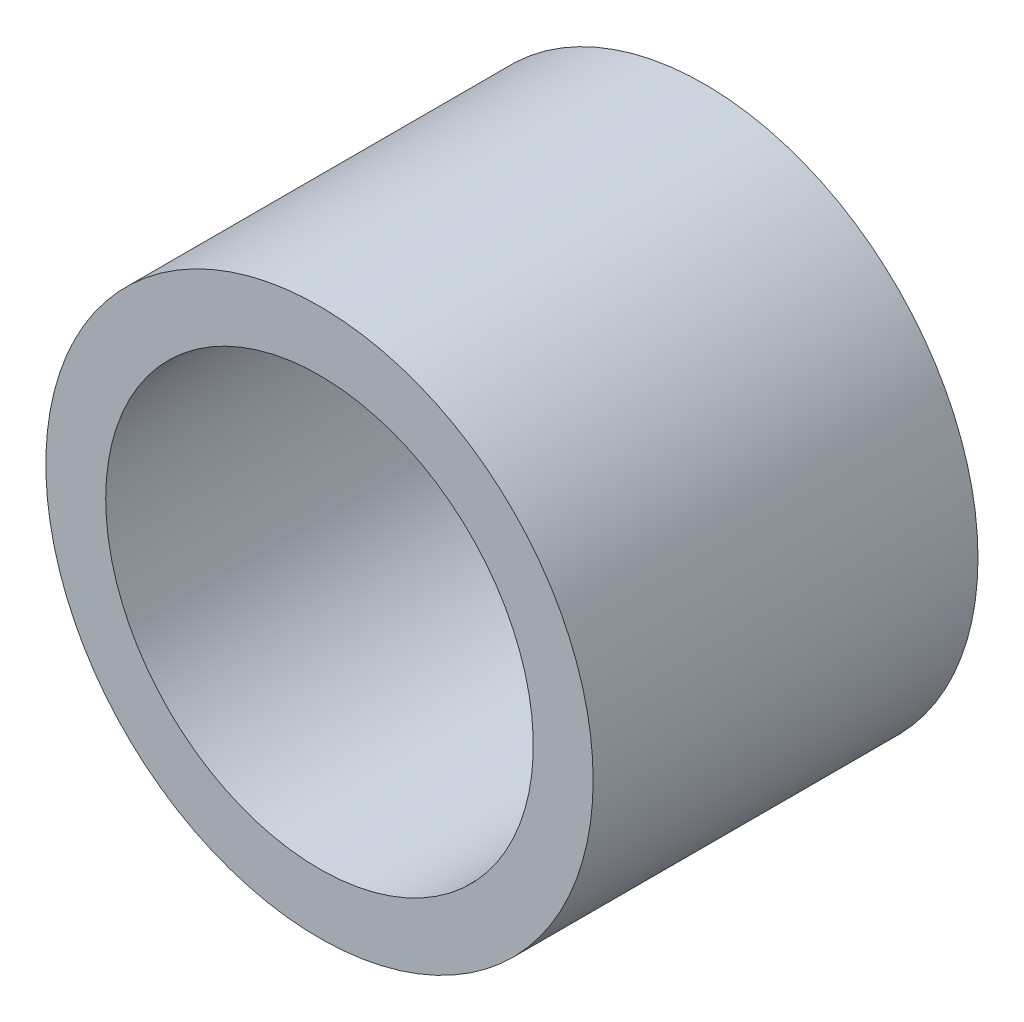
ISO-10303-21;
HEADER;
FILE_DESCRIPTION(('STEP AP214'),'2;1');
FILE_NAME('part.step','',(''),(''),'','','');
FILE_SCHEMA(('AUTOMOTIVE_DESIGN { 1 0 10303 214 1 1 1 1 }'));
ENDSEC;
DATA;
#1=APPLICATION_CONTEXT('core data for automotive mechanical design processes');
#2=APPLICATION_PROTOCOL_DEFINITION('international standard','automotive_design',2000,#1);
#3=PRODUCT_CONTEXT('',#1,'mechanical');
#4=PRODUCT('Part','Part','',(#3));
#5=PRODUCT_RELATED_PRODUCT_CATEGORY('part','',(#4));
#6=PRODUCT_DEFINITION_FORMATION('','',#4);
#7=PRODUCT_DEFINITION_CONTEXT('part definition',#1,'design');
#8=PRODUCT_DEFINITION('design','',#6,#7);
#9=PRODUCT_DEFINITION_SHAPE('','',#8);
#10=(LENGTH_UNIT() NAMED_UNIT(*) SI_UNIT(.MILLI.,.METRE.));
#11=(NAMED_UNIT(*) PLANE_ANGLE_UNIT() SI_UNIT($,.RADIAN.));
#12=(NAMED_UNIT(*) SI_UNIT($,.STERADIAN.) SOLID_ANGLE_UNIT());
#13=UNCERTAINTY_MEASURE_WITH_UNIT(LENGTH_MEASURE(1.E-05),#10,'distance_accuracy_value','');
#14=(GEOMETRIC_REPRESENTATION_CONTEXT(3) GLOBAL_UNCERTAINTY_ASSIGNED_CONTEXT((#13)) GLOBAL_UNIT_ASSIGNED_CONTEXT((#10,
#11,#12)) REPRESENTATION_CONTEXT('',''));
#15=CARTESIAN_POINT('',(0.,0.,0.));
#16=DIRECTION('',(0.,0.,1.));
#17=DIRECTION('',(1.,0.,0.));
#18=AXIS2_PLACEMENT_3D('',#15,#16,#17);
#19=CARTESIAN_POINT('',(0.,0.,22.5));
#20=DIRECTION('',(0.,0.,-1.));
#21=DIRECTION('',(-1.,0.,0.));
#22=AXIS2_PLACEMENT_3D('',#19,#20,#21);
#23=CYLINDRICAL_SURFACE('',#22,16.);
#24=CARTESIAN_POINT('',(0.,0.,22.5));
#25=DIRECTION('',(0.,0.,1.));
#26=DIRECTION('',(1.,0.,0.));
#27=AXIS2_PLACEMENT_3D('',#24,#25,#26);
#28=CIRCLE('',#27,16.);
#29=CARTESIAN_POINT('',(16.,0.,22.5));
#30=VERTEX_POINT('',#29);
#31=EDGE_CURVE('E10',#30,#30,#28,.T.);
#32=ORIENTED_EDGE('',*,*,#31,.F.);
#33=EDGE_LOOP('',(#32));
#34=FACE_BOUND('',#33,.T.);
#35=CARTESIAN_POINT('',(0.,0.,0.));
#36=DIRECTION('',(0.,0.,1.));
#37=DIRECTION('',(1.,0.,0.));
#38=AXIS2_PLACEMENT_3D('',#35,#36,#37);
#39=CIRCLE('',#38,16.);
#40=CARTESIAN_POINT('',(16.,0.,0.));
#41=VERTEX_POINT('',#40);
#42=EDGE_CURVE('E33',#41,#41,#39,.T.);
#43=ORIENTED_EDGE('',*,*,#42,.T.);
#44=EDGE_LOOP('',(#43));
#45=FACE_BOUND('',#44,.T.);
#46=ADVANCED_FACE('F30',(#34,#45),#23,.T.);
#47=CARTESIAN_POINT('',(0.,0.,22.5));
#48=DIRECTION('',(0.,0.,1.));
#49=DIRECTION('',(1.,0.,0.));
#50=AXIS2_PLACEMENT_3D('',#47,#48,#49);
#51=PLANE('',#50);
#52=CARTESIAN_POINT('',(0.,0.,22.5));
#53=DIRECTION('',(0.,0.,-1.));
#54=DIRECTION('',(-1.,0.,0.));
#55=AXIS2_PLACEMENT_3D('',#52,#53,#54);
#56=CIRCLE('',#55,12.5);
#57=CARTESIAN_POINT('',(-12.5,0.,22.5));
#58=VERTEX_POINT('',#57);
#59=EDGE_CURVE('E45',#58,#58,#56,.T.);
#60=ORIENTED_EDGE('',*,*,#59,.T.);
#61=EDGE_LOOP('',(#60));
#62=FACE_BOUND('',#61,.T.);
#63=ORIENTED_EDGE('',*,*,#31,.T.);
#64=EDGE_LOOP('',(#63));
#65=FACE_BOUND('',#64,.T.);
#66=ADVANCED_FACE('F54',(#62,#65),#51,.T.);
#67=CARTESIAN_POINT('',(0.,0.,0.));
#68=DIRECTION('',(0.,0.,1.));
#69=DIRECTION('',(1.,0.,0.));
#70=AXIS2_PLACEMENT_3D('',#67,#68,#69);
#71=PLANE('',#70);
#72=CARTESIAN_POINT('',(0.,0.,0.));
#73=DIRECTION('',(0.,0.,-1.));
#74=DIRECTION('',(-1.,0.,0.));
#75=AXIS2_PLACEMENT_3D('',#72,#73,#74);
#76=CIRCLE('',#75,15.);
#77=CARTESIAN_POINT('',(-15.,0.,0.));
#78=VERTEX_POINT('',#77);
#79=EDGE_CURVE('E42',#78,#78,#76,.T.);
#80=ORIENTED_EDGE('',*,*,#79,.F.);
#81=EDGE_LOOP('',(#80));
#82=FACE_BOUND('',#81,.T.);
#83=ORIENTED_EDGE('',*,*,#42,.F.);
#84=EDGE_LOOP('',(#83));
#85=FACE_BOUND('',#84,.T.);
#86=ADVANCED_FACE('F71',(#82,#85),#71,.F.);
#87=CARTESIAN_POINT('',(0.,0.,4.));
#88=DIRECTION('',(0.,0.,-1.));
#89=DIRECTION('',(-1.,0.,0.));
#90=AXIS2_PLACEMENT_3D('',#87,#88,#89);
#91=CYLINDRICAL_SURFACE('',#90,15.);
#92=CARTESIAN_POINT('',(0.,0.,4.));
#93=DIRECTION('',(0.,0.,-1.));
#94=DIRECTION('',(-1.,0.,0.));
#95=AXIS2_PLACEMENT_3D('',#92,#93,#94);
#96=CIRCLE('',#95,15.);
#97=CARTESIAN_POINT('',(-15.,0.,4.));
#98=VERTEX_POINT('',#97);
#99=EDGE_CURVE('E40',#98,#98,#96,.T.);
#100=ORIENTED_EDGE('',*,*,#99,.F.);
#101=EDGE_LOOP('',(#100));
#102=FACE_BOUND('',#101,.T.);
#103=ORIENTED_EDGE('',*,*,#79,.T.);
#104=EDGE_LOOP('',(#103));
#105=FACE_BOUND('',#104,.T.);
#106=ADVANCED_FACE('F65',(#102,#105),#91,.F.);
#107=CARTESIAN_POINT('',(0.,0.,4.));
#108=DIRECTION('',(0.,0.,-1.));
#109=DIRECTION('',(-1.,0.,0.));
#110=AXIS2_PLACEMENT_3D('',#107,#108,#109);
#111=PLANE('',#110);
#112=CARTESIAN_POINT('',(0.,0.,4.));
#113=DIRECTION('',(0.,0.,-1.));
#114=DIRECTION('',(-1.,0.,0.));
#115=AXIS2_PLACEMENT_3D('',#112,#113,#114);
#116=CIRCLE('',#115,12.5);
#117=CARTESIAN_POINT('',(-12.5,0.,4.));
#118=VERTEX_POINT('',#117);
#119=EDGE_CURVE('E48',#118,#118,#116,.T.);
#120=ORIENTED_EDGE('',*,*,#119,.F.);
#121=EDGE_LOOP('',(#120));
#122=FACE_BOUND('',#121,.T.);
#123=ORIENTED_EDGE('',*,*,#99,.T.);
#124=EDGE_LOOP('',(#123));
#125=FACE_BOUND('',#124,.T.);
#126=ADVANCED_FACE('F59',(#122,#125),#111,.T.);
#127=CARTESIAN_POINT('',(0.,0.,22.5));
#128=DIRECTION('',(0.,0.,-1.));
#129=DIRECTION('',(-1.,0.,0.));
#130=AXIS2_PLACEMENT_3D('',#127,#128,#129);
#131=CYLINDRICAL_SURFACE('',#130,12.5);
#132=ORIENTED_EDGE('',*,*,#59,.F.);
#133=EDGE_LOOP('',(#132));
#134=FACE_BOUND('',#133,.T.);
#135=ORIENTED_EDGE('',*,*,#119,.T.);
#136=EDGE_LOOP('',(#135));
#137=FACE_BOUND('',#136,.T.);
#138=ADVANCED_FACE('F56',(#134,#137),#131,.F.);
#139=CLOSED_SHELL('',(#46,#66,#86,#106,#126,#138));
#140=MANIFOLD_SOLID_BREP('B2',#139);
#141=ADVANCED_BREP_SHAPE_REPRESENTATION('',(#18,#140),#14);
#142=SHAPE_DEFINITION_REPRESENTATION(#9,#141);
ENDSEC;
END-ISO-10303-21;
